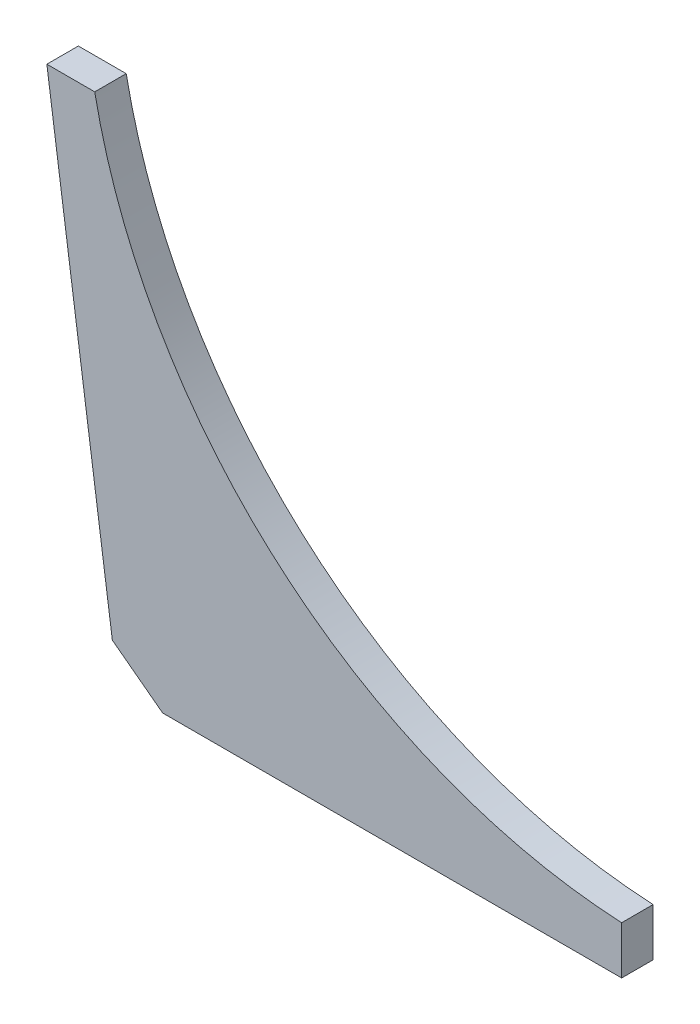
ISO-10303-21;
HEADER;
FILE_DESCRIPTION(('STEP AP214'),'2;1');
FILE_NAME('part.step','',(''),(''),'','','');
FILE_SCHEMA(('AUTOMOTIVE_DESIGN { 1 0 10303 214 1 1 1 1 }'));
ENDSEC;
DATA;
#1=APPLICATION_CONTEXT('core data for automotive mechanical design processes');
#2=APPLICATION_PROTOCOL_DEFINITION('international standard','automotive_design',2000,#1);
#3=PRODUCT_CONTEXT('',#1,'mechanical');
#4=PRODUCT('Part','Part','',(#3));
#5=PRODUCT_RELATED_PRODUCT_CATEGORY('part','',(#4));
#6=PRODUCT_DEFINITION_FORMATION('','',#4);
#7=PRODUCT_DEFINITION_CONTEXT('part definition',#1,'design');
#8=PRODUCT_DEFINITION('design','',#6,#7);
#9=PRODUCT_DEFINITION_SHAPE('','',#8);
#10=(LENGTH_UNIT() NAMED_UNIT(*) SI_UNIT(.MILLI.,.METRE.));
#11=(NAMED_UNIT(*) PLANE_ANGLE_UNIT() SI_UNIT($,.RADIAN.));
#12=(NAMED_UNIT(*) SI_UNIT($,.STERADIAN.) SOLID_ANGLE_UNIT());
#13=UNCERTAINTY_MEASURE_WITH_UNIT(LENGTH_MEASURE(1.E-05),#10,'distance_accuracy_value','');
#14=(GEOMETRIC_REPRESENTATION_CONTEXT(3) GLOBAL_UNCERTAINTY_ASSIGNED_CONTEXT((#13)) GLOBAL_UNIT_ASSIGNED_CONTEXT((#10,
#11,#12)) REPRESENTATION_CONTEXT('',''));
#15=CARTESIAN_POINT('',(0.,0.,0.));
#16=DIRECTION('',(0.,0.,1.));
#17=DIRECTION('',(1.,0.,0.));
#18=AXIS2_PLACEMENT_3D('',#15,#16,#17);
#19=CARTESIAN_POINT('',(-70.5649942168611,41.003648854743,6.35));
#20=DIRECTION('',(0.,0.,1.));
#21=DIRECTION('',(1.,0.,0.));
#22=AXIS2_PLACEMENT_3D('',#19,#20,#21);
#23=PLANE('',#22);
#24=DIRECTION('',(0.798635510047294,-0.601815023152047,0.));
#25=VECTOR('',#24,1.);
#26=CARTESIAN_POINT('',(-91.8279063659241,5.85611533307116,6.35));
#27=LINE('',#26,#25);
#28=CARTESIAN_POINT('',(-91.8279063659241,5.85611533307116,6.35));
#29=VERTEX_POINT('',#28);
#30=CARTESIAN_POINT('',(-101.970577343525,13.4991661271022,6.35));
#31=VERTEX_POINT('',#30);
#32=EDGE_CURVE('E71',#29,#31,#27,.F.);
#33=ORIENTED_EDGE('',*,*,#32,.F.);
#34=DIRECTION('',(1.,0.,0.));
#35=VECTOR('',#34,1.);
#36=CARTESIAN_POINT('',(0.703583394741242,5.85611533307116,6.35));
#37=LINE('',#36,#35);
#38=CARTESIAN_POINT('',(0.703583394741242,5.85611533307116,6.35));
#39=VERTEX_POINT('',#38);
#40=EDGE_CURVE('E93',#39,#29,#37,.F.);
#41=ORIENTED_EDGE('',*,*,#40,.F.);
#42=DIRECTION('',(0.,1.,0.));
#43=VECTOR('',#42,1.);
#44=CARTESIAN_POINT('',(0.703583394741242,15.5081153330712,6.35));
#45=LINE('',#44,#43);
#46=CARTESIAN_POINT('',(0.703583394741236,15.5081153330709,6.35));
#47=VERTEX_POINT('',#46);
#48=EDGE_CURVE('E55',#47,#39,#45,.F.);
#49=ORIENTED_EDGE('',*,*,#48,.F.);
#50=CARTESIAN_POINT('',(6.60004241780741,129.655922018041,6.35));
#51=DIRECTION('',(0.,0.,1.));
#52=DIRECTION('',(1.,0.,0.));
#53=AXIS2_PLACEMENT_3D('',#50,#51,#52);
#54=CIRCLE('',#53,114.3);
#55=CARTESIAN_POINT('',(-105.523365411022,107.456115333071,6.35));
#56=VERTEX_POINT('',#55);
#57=EDGE_CURVE('E20',#47,#56,#54,.F.);
#58=ORIENTED_EDGE('',*,*,#57,.T.);
#59=DIRECTION('',(1.,0.,0.));
#60=VECTOR('',#59,1.);
#61=CARTESIAN_POINT('',(-115.175365411022,107.456115333071,6.35));
#62=LINE('',#61,#60);
#63=CARTESIAN_POINT('',(-115.175365411022,107.456115333071,6.35));
#64=VERTEX_POINT('',#63);
#65=EDGE_CURVE('E84',#64,#56,#62,.T.);
#66=ORIENTED_EDGE('',*,*,#65,.F.);
#67=DIRECTION('',(0.139173100960066,-0.99026806874157,0.));
#68=VECTOR('',#67,1.);
#69=CARTESIAN_POINT('',(-101.970577343525,13.4991661271021,6.35));
#70=LINE('',#69,#68);
#71=EDGE_CURVE('E81',#31,#64,#70,.F.);
#72=ORIENTED_EDGE('',*,*,#71,.F.);
#73=EDGE_LOOP('',(#33,#41,#49,#58,#66,#72));
#74=FACE_BOUND('',#73,.T.);
#75=ADVANCED_FACE('F17',(#74),#23,.T.);
#76=CARTESIAN_POINT('',(-101.970577343525,13.4991661271021,0.));
#77=DIRECTION('',(-0.99026806874157,-0.139173100960066,0.));
#78=DIRECTION('',(0.139173100960066,-0.99026806874157,0.));
#79=AXIS2_PLACEMENT_3D('',#76,#77,#78);
#80=PLANE('',#79);
#81=ORIENTED_EDGE('',*,*,#71,.T.);
#82=DIRECTION('',(0.,0.,1.));
#83=VECTOR('',#82,1.);
#84=CARTESIAN_POINT('',(-115.175365411022,107.456115333071,0.));
#85=LINE('',#84,#83);
#86=CARTESIAN_POINT('',(-115.175365411022,107.456115333071,0.));
#87=VERTEX_POINT('',#86);
#88=EDGE_CURVE('E103',#87,#64,#85,.T.);
#89=ORIENTED_EDGE('',*,*,#88,.F.);
#90=DIRECTION('',(0.139173100960065,-0.99026806874157,0.));
#91=VECTOR('',#90,1.);
#92=CARTESIAN_POINT('',(-115.175365411022,107.456115333071,0.));
#93=LINE('',#92,#91);
#94=CARTESIAN_POINT('',(-101.970577343525,13.4991661271022,0.));
#95=VERTEX_POINT('',#94);
#96=EDGE_CURVE('E92',#87,#95,#93,.T.);
#97=ORIENTED_EDGE('',*,*,#96,.T.);
#98=DIRECTION('',(0.,0.,1.));
#99=VECTOR('',#98,1.);
#100=CARTESIAN_POINT('',(-101.970577343525,13.4991661271023,0.));
#101=LINE('',#100,#99);
#102=EDGE_CURVE('E76',#31,#95,#101,.F.);
#103=ORIENTED_EDGE('',*,*,#102,.F.);
#104=EDGE_LOOP('',(#81,#89,#97,#103));
#105=FACE_BOUND('',#104,.T.);
#106=ADVANCED_FACE('F90',(#105),#80,.T.);
#107=CARTESIAN_POINT('',(-91.8279063659241,5.85611533307116,0.));
#108=DIRECTION('',(-0.601815023152047,-0.798635510047294,0.));
#109=DIRECTION('',(0.798635510047294,-0.601815023152047,0.));
#110=AXIS2_PLACEMENT_3D('',#107,#108,#109);
#111=PLANE('',#110);
#112=ORIENTED_EDGE('',*,*,#32,.T.);
#113=ORIENTED_EDGE('',*,*,#102,.T.);
#114=DIRECTION('',(0.798635510047304,-0.601815023152034,0.));
#115=VECTOR('',#114,1.);
#116=CARTESIAN_POINT('',(-101.970577343525,13.4991661271021,0.));
#117=LINE('',#116,#115);
#118=CARTESIAN_POINT('',(-91.8279063659241,5.85611533307116,0.));
#119=VERTEX_POINT('',#118);
#120=EDGE_CURVE('E123',#95,#119,#117,.T.);
#121=ORIENTED_EDGE('',*,*,#120,.T.);
#122=DIRECTION('',(0.,0.,-1.));
#123=VECTOR('',#122,1.);
#124=CARTESIAN_POINT('',(-91.8279063659241,5.85611533307116,0.));
#125=LINE('',#124,#123);
#126=EDGE_CURVE('E79',#29,#119,#125,.T.);
#127=ORIENTED_EDGE('',*,*,#126,.F.);
#128=EDGE_LOOP('',(#112,#113,#121,#127));
#129=FACE_BOUND('',#128,.T.);
#130=ADVANCED_FACE('F73',(#129),#111,.T.);
#131=CARTESIAN_POINT('',(0.703583394741242,5.85611533307116,0.));
#132=DIRECTION('',(0.,-1.,0.));
#133=DIRECTION('',(0.,0.,-1.));
#134=AXIS2_PLACEMENT_3D('',#131,#132,#133);
#135=PLANE('',#134);
#136=ORIENTED_EDGE('',*,*,#40,.T.);
#137=ORIENTED_EDGE('',*,*,#126,.T.);
#138=DIRECTION('',(1.,0.,0.));
#139=VECTOR('',#138,1.);
#140=CARTESIAN_POINT('',(-70.5649942168611,5.85611533307116,0.));
#141=LINE('',#140,#139);
#142=CARTESIAN_POINT('',(0.703583394741246,5.85611533307116,0.));
#143=VERTEX_POINT('',#142);
#144=EDGE_CURVE('E119',#119,#143,#141,.T.);
#145=ORIENTED_EDGE('',*,*,#144,.T.);
#146=DIRECTION('',(0.,0.,-1.));
#147=VECTOR('',#146,1.);
#148=CARTESIAN_POINT('',(0.703583394741242,5.85611533307116,0.));
#149=LINE('',#148,#147);
#150=EDGE_CURVE('E109',#39,#143,#149,.T.);
#151=ORIENTED_EDGE('',*,*,#150,.F.);
#152=EDGE_LOOP('',(#136,#137,#145,#151));
#153=FACE_BOUND('',#152,.T.);
#154=ADVANCED_FACE('F151',(#153),#135,.T.);
#155=CARTESIAN_POINT('',(0.703583394741242,15.5081153330712,0.));
#156=DIRECTION('',(1.,0.,0.));
#157=DIRECTION('',(0.,0.,-1.));
#158=AXIS2_PLACEMENT_3D('',#155,#156,#157);
#159=PLANE('',#158);
#160=ORIENTED_EDGE('',*,*,#48,.T.);
#161=ORIENTED_EDGE('',*,*,#150,.T.);
#162=DIRECTION('',(0.,1.,0.));
#163=VECTOR('',#162,1.);
#164=CARTESIAN_POINT('',(0.703583394741247,41.003648854743,0.));
#165=LINE('',#164,#163);
#166=CARTESIAN_POINT('',(0.703583394741239,15.5081153330709,0.));
#167=VERTEX_POINT('',#166);
#168=EDGE_CURVE('E116',#143,#167,#165,.T.);
#169=ORIENTED_EDGE('',*,*,#168,.T.);
#170=DIRECTION('',(0.,0.,1.));
#171=VECTOR('',#170,1.);
#172=CARTESIAN_POINT('',(0.70358339474123,15.5081153330709,0.));
#173=LINE('',#172,#171);
#174=EDGE_CURVE('E132',#167,#47,#173,.T.);
#175=ORIENTED_EDGE('',*,*,#174,.T.);
#176=EDGE_LOOP('',(#160,#161,#169,#175));
#177=FACE_BOUND('',#176,.T.);
#178=ADVANCED_FACE('F156',(#177),#159,.T.);
#179=CARTESIAN_POINT('',(6.60004241780741,129.655922018041,0.));
#180=DIRECTION('',(0.,0.,1.));
#181=DIRECTION('',(1.,0.,0.));
#182=AXIS2_PLACEMENT_3D('',#179,#180,#181);
#183=CYLINDRICAL_SURFACE('',#182,114.3);
#184=CARTESIAN_POINT('',(6.60004241780741,129.655922018041,0.));
#185=DIRECTION('',(0.,0.,1.));
#186=DIRECTION('',(1.,0.,0.));
#187=AXIS2_PLACEMENT_3D('',#184,#185,#186);
#188=CIRCLE('',#187,114.3);
#189=CARTESIAN_POINT('',(-105.523365411022,107.456115333071,0.));
#190=VERTEX_POINT('',#189);
#191=EDGE_CURVE('E26',#167,#190,#188,.F.);
#192=ORIENTED_EDGE('',*,*,#191,.T.);
#193=DIRECTION('',(0.,0.,1.));
#194=VECTOR('',#193,1.);
#195=CARTESIAN_POINT('',(-105.523365411022,107.456115333071,0.));
#196=LINE('',#195,#194);
#197=EDGE_CURVE('E34',#56,#190,#196,.F.);
#198=ORIENTED_EDGE('',*,*,#197,.F.);
#199=ORIENTED_EDGE('',*,*,#57,.F.);
#200=ORIENTED_EDGE('',*,*,#174,.F.);
#201=EDGE_LOOP('',(#192,#198,#199,#200));
#202=FACE_BOUND('',#201,.T.);
#203=ADVANCED_FACE('F154',(#202),#183,.F.);
#204=CARTESIAN_POINT('',(-115.175365411022,107.456115333071,0.));
#205=DIRECTION('',(0.,1.,0.));
#206=DIRECTION('',(0.,0.,1.));
#207=AXIS2_PLACEMENT_3D('',#204,#205,#206);
#208=PLANE('',#207);
#209=ORIENTED_EDGE('',*,*,#65,.T.);
#210=ORIENTED_EDGE('',*,*,#197,.T.);
#211=DIRECTION('',(1.,0.,0.));
#212=VECTOR('',#211,1.);
#213=CARTESIAN_POINT('',(-70.5649942168611,107.456115333071,0.));
#214=LINE('',#213,#212);
#215=EDGE_CURVE('E11',#190,#87,#214,.F.);
#216=ORIENTED_EDGE('',*,*,#215,.T.);
#217=ORIENTED_EDGE('',*,*,#88,.T.);
#218=EDGE_LOOP('',(#209,#210,#216,#217));
#219=FACE_BOUND('',#218,.T.);
#220=ADVANCED_FACE('F153',(#219),#208,.T.);
#221=CARTESIAN_POINT('',(-70.5649942168611,41.003648854743,0.));
#222=DIRECTION('',(0.,0.,1.));
#223=DIRECTION('',(1.,0.,0.));
#224=AXIS2_PLACEMENT_3D('',#221,#222,#223);
#225=PLANE('',#224);
#226=ORIENTED_EDGE('',*,*,#191,.F.);
#227=ORIENTED_EDGE('',*,*,#168,.F.);
#228=ORIENTED_EDGE('',*,*,#144,.F.);
#229=ORIENTED_EDGE('',*,*,#120,.F.);
#230=ORIENTED_EDGE('',*,*,#96,.F.);
#231=ORIENTED_EDGE('',*,*,#215,.F.);
#232=EDGE_LOOP('',(#226,#227,#228,#229,#230,#231));
#233=FACE_BOUND('',#232,.T.);
#234=ADVANCED_FACE('F148',(#233),#225,.F.);
#235=CLOSED_SHELL('',(#75,#106,#130,#154,#178,#203,#220,#234));
#236=MANIFOLD_SOLID_BREP('B1',#235);
#237=ADVANCED_BREP_SHAPE_REPRESENTATION('',(#18,#236),#14);
#238=SHAPE_DEFINITION_REPRESENTATION(#9,#237);
ENDSEC;
END-ISO-10303-21;
